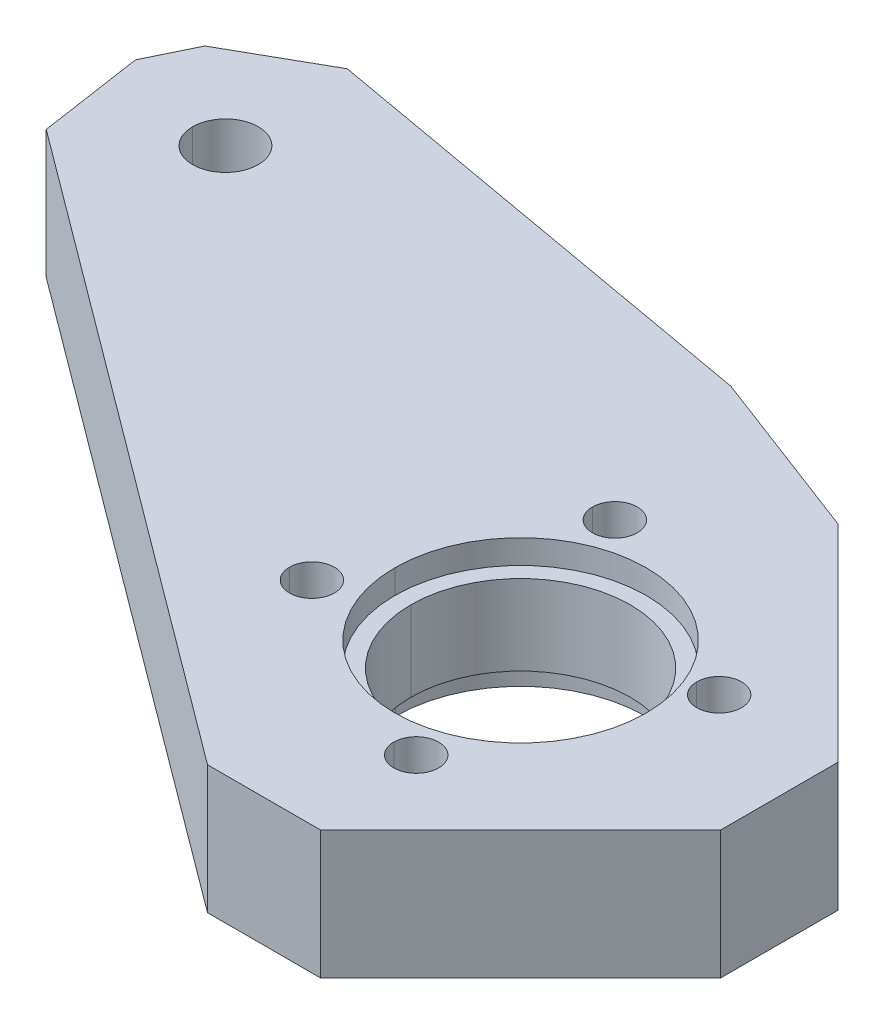
ISO-10303-21;
HEADER;
FILE_DESCRIPTION(('STEP AP214'),'2;1');
FILE_NAME('part.step','',(''),(''),'','','');
FILE_SCHEMA(('AUTOMOTIVE_DESIGN { 1 0 10303 214 1 1 1 1 }'));
ENDSEC;
DATA;
#1=APPLICATION_CONTEXT('core data for automotive mechanical design processes');
#2=APPLICATION_PROTOCOL_DEFINITION('international standard','automotive_design',2000,#1);
#3=PRODUCT_CONTEXT('',#1,'mechanical');
#4=PRODUCT('Part','Part','',(#3));
#5=PRODUCT_RELATED_PRODUCT_CATEGORY('part','',(#4));
#6=PRODUCT_DEFINITION_FORMATION('','',#4);
#7=PRODUCT_DEFINITION_CONTEXT('part definition',#1,'design');
#8=PRODUCT_DEFINITION('design','',#6,#7);
#9=PRODUCT_DEFINITION_SHAPE('','',#8);
#10=(LENGTH_UNIT() NAMED_UNIT(*) SI_UNIT(.MILLI.,.METRE.));
#11=(NAMED_UNIT(*) PLANE_ANGLE_UNIT() SI_UNIT($,.RADIAN.));
#12=(NAMED_UNIT(*) SI_UNIT($,.STERADIAN.) SOLID_ANGLE_UNIT());
#13=UNCERTAINTY_MEASURE_WITH_UNIT(LENGTH_MEASURE(1.E-05),#10,'distance_accuracy_value','');
#14=(GEOMETRIC_REPRESENTATION_CONTEXT(3) GLOBAL_UNCERTAINTY_ASSIGNED_CONTEXT((#13)) GLOBAL_UNIT_ASSIGNED_CONTEXT((#10,
#11,#12)) REPRESENTATION_CONTEXT('',''));
#15=CARTESIAN_POINT('',(0.,0.,0.));
#16=DIRECTION('',(0.,0.,1.));
#17=DIRECTION('',(1.,0.,0.));
#18=AXIS2_PLACEMENT_3D('',#15,#16,#17);
#19=CARTESIAN_POINT('',(58.0177872912911,-116.6486020619,40.2206991423906));
#20=DIRECTION('',(-0.898794046158571,0.,-0.438371147077342));
#21=DIRECTION('',(-0.438371147077342,0.,0.898794046158571));
#22=AXIS2_PLACEMENT_3D('',#19,#20,#21);
#23=PLANE('',#22);
#24=DIRECTION('',(0.,1.,0.));
#25=VECTOR('',#24,1.);
#26=CARTESIAN_POINT('',(58.0177872912911,-116.6486020619,40.2206991423906));
#27=LINE('',#26,#25);
#28=CARTESIAN_POINT('',(58.0177872912911,-43.500004703,40.2206991423906));
#29=VERTEX_POINT('',#28);
#30=CARTESIAN_POINT('',(58.0177872912911,-35.500004703,40.2206991423906));
#31=VERTEX_POINT('',#30);
#32=EDGE_CURVE('E248',#29,#31,#27,.T.);
#33=ORIENTED_EDGE('',*,*,#32,.F.);
#34=DIRECTION('',(-0.438371147077342,0.,0.898794046158571));
#35=VECTOR('',#34,1.);
#36=CARTESIAN_POINT('',(58.0177872912911,-43.500004703,40.2206991423906));
#37=LINE('',#36,#35);
#38=CARTESIAN_POINT('',(56.5968550797981,-43.500004703,43.1340419118671));
#39=VERTEX_POINT('',#38);
#40=EDGE_CURVE('E250',#29,#39,#37,.T.);
#41=ORIENTED_EDGE('',*,*,#40,.T.);
#42=DIRECTION('',(0.,1.,0.));
#43=VECTOR('',#42,1.);
#44=CARTESIAN_POINT('',(56.5968550797981,-116.6486020619,43.1340419118671));
#45=LINE('',#44,#43);
#46=CARTESIAN_POINT('',(56.5968550797981,-35.500004703,43.1340419118671));
#47=VERTEX_POINT('',#46);
#48=EDGE_CURVE('E11',#39,#47,#45,.T.);
#49=ORIENTED_EDGE('',*,*,#48,.T.);
#50=DIRECTION('',(-0.438371147077342,0.,0.898794046158571));
#51=VECTOR('',#50,1.);
#52=CARTESIAN_POINT('',(58.0177872912911,-35.500004703,40.2206991423906));
#53=LINE('',#52,#51);
#54=EDGE_CURVE('E253',#31,#47,#53,.T.);
#55=ORIENTED_EDGE('',*,*,#54,.F.);
#56=EDGE_LOOP('',(#33,#41,#49,#55));
#57=FACE_BOUND('',#56,.T.);
#58=ADVANCED_FACE('F16',(#57),#23,.T.);
#59=CARTESIAN_POINT('',(56.5968550797981,-116.6486020619,43.1340419118671));
#60=DIRECTION('',(-0.989059110515778,0.,0.147519747511098));
#61=DIRECTION('',(0.,1.,0.));
#62=AXIS2_PLACEMENT_3D('',#59,#60,#61);
#63=PLANE('',#62);
#64=ORIENTED_EDGE('',*,*,#48,.F.);
#65=DIRECTION('',(0.147519747511098,0.,0.989059110515778));
#66=VECTOR('',#65,1.);
#67=CARTESIAN_POINT('',(56.5968550797981,-43.500004703,43.1340419118671));
#68=LINE('',#67,#66);
#69=CARTESIAN_POINT('',(57.5738866518634,-43.500004703,49.6846359436255));
#70=VERTEX_POINT('',#69);
#71=EDGE_CURVE('E268',#39,#70,#68,.T.);
#72=ORIENTED_EDGE('',*,*,#71,.T.);
#73=DIRECTION('',(0.,1.,0.));
#74=VECTOR('',#73,1.);
#75=CARTESIAN_POINT('',(57.5738866518634,-116.6486020619,49.6846359436255));
#76=LINE('',#75,#74);
#77=CARTESIAN_POINT('',(57.5738866518634,-35.500004703,49.6846359436255));
#78=VERTEX_POINT('',#77);
#79=EDGE_CURVE('E19',#70,#78,#76,.T.);
#80=ORIENTED_EDGE('',*,*,#79,.T.);
#81=DIRECTION('',(0.147519747511098,0.,0.989059110515778));
#82=VECTOR('',#81,1.);
#83=CARTESIAN_POINT('',(56.5968550797981,-35.500004703,43.1340419118671));
#84=LINE('',#83,#82);
#85=EDGE_CURVE('E453',#47,#78,#84,.T.);
#86=ORIENTED_EDGE('',*,*,#85,.F.);
#87=EDGE_LOOP('',(#64,#72,#80,#86));
#88=FACE_BOUND('',#87,.T.);
#89=ADVANCED_FACE('F554',(#88),#63,.T.);
#90=CARTESIAN_POINT('',(57.5738866518634,-116.6486020619,49.6846359436255));
#91=DIRECTION('',(-0.597091059082043,0.,0.802173464510192));
#92=DIRECTION('',(0.,1.,0.));
#93=AXIS2_PLACEMENT_3D('',#90,#91,#92);
#94=PLANE('',#93);
#95=ORIENTED_EDGE('',*,*,#79,.F.);
#96=DIRECTION('',(0.802173464510192,0.,0.597091059082043));
#97=VECTOR('',#96,1.);
#98=CARTESIAN_POINT('',(57.5738866518634,-43.500004703,49.6846359436255));
#99=LINE('',#98,#97);
#100=CARTESIAN_POINT('',(96.9523845078725,-43.500004703,78.995689014));
#101=VERTEX_POINT('',#100);
#102=EDGE_CURVE('E303',#70,#101,#99,.T.);
#103=ORIENTED_EDGE('',*,*,#102,.T.);
#104=DIRECTION('',(0.,1.,0.));
#105=VECTOR('',#104,1.);
#106=CARTESIAN_POINT('',(96.9523845078725,-116.6486020619,78.995689014));
#107=LINE('',#106,#105);
#108=CARTESIAN_POINT('',(96.9523845078725,-35.500004703,78.995689014));
#109=VERTEX_POINT('',#108);
#110=EDGE_CURVE('E327',#101,#109,#107,.T.);
#111=ORIENTED_EDGE('',*,*,#110,.T.);
#112=DIRECTION('',(0.802173464510192,0.,0.597091059082043));
#113=VECTOR('',#112,1.);
#114=CARTESIAN_POINT('',(57.5738866518634,-35.500004703,49.6846359436255));
#115=LINE('',#114,#113);
#116=EDGE_CURVE('E457',#78,#109,#115,.T.);
#117=ORIENTED_EDGE('',*,*,#116,.F.);
#118=EDGE_LOOP('',(#95,#103,#111,#117));
#119=FACE_BOUND('',#118,.T.);
#120=ADVANCED_FACE('F559',(#119),#94,.T.);
#121=CARTESIAN_POINT('',(96.9523845078725,-116.6486020619,78.995689014));
#122=DIRECTION('',(0.,0.,1.));
#123=DIRECTION('',(1.,0.,0.));
#124=AXIS2_PLACEMENT_3D('',#121,#122,#123);
#125=PLANE('',#124);
#126=ORIENTED_EDGE('',*,*,#110,.F.);
#127=DIRECTION('',(1.,0.,0.));
#128=VECTOR('',#127,1.);
#129=CARTESIAN_POINT('',(96.9523845078725,-43.500004703,78.995689014));
#130=LINE('',#129,#128);
#131=CARTESIAN_POINT('',(104.010446024746,-43.500004703,78.995689014));
#132=VERTEX_POINT('',#131);
#133=EDGE_CURVE('E298',#101,#132,#130,.T.);
#134=ORIENTED_EDGE('',*,*,#133,.T.);
#135=DIRECTION('',(0.,1.,0.));
#136=VECTOR('',#135,1.);
#137=CARTESIAN_POINT('',(104.010446024746,-116.6486020619,78.995689014));
#138=LINE('',#137,#136);
#139=CARTESIAN_POINT('',(104.010446024746,-35.500004703,78.995689014));
#140=VERTEX_POINT('',#139);
#141=EDGE_CURVE('E326',#132,#140,#138,.T.);
#142=ORIENTED_EDGE('',*,*,#141,.T.);
#143=DIRECTION('',(1.,0.,0.));
#144=VECTOR('',#143,1.);
#145=CARTESIAN_POINT('',(96.9523845078725,-35.500004703,78.995689014));
#146=LINE('',#145,#144);
#147=EDGE_CURVE('E461',#109,#140,#146,.T.);
#148=ORIENTED_EDGE('',*,*,#147,.F.);
#149=EDGE_LOOP('',(#126,#134,#142,#148));
#150=FACE_BOUND('',#149,.T.);
#151=ADVANCED_FACE('F564',(#150),#125,.T.);
#152=CARTESIAN_POINT('',(104.010446024746,-116.6486020619,78.995689014));
#153=DIRECTION('',(0.707106781186548,0.,0.707106781186548));
#154=DIRECTION('',(0.,-1.,0.));
#155=AXIS2_PLACEMENT_3D('',#152,#153,#154);
#156=PLANE('',#155);
#157=ORIENTED_EDGE('',*,*,#141,.F.);
#158=DIRECTION('',(0.707106781186548,0.,-0.707106781186548));
#159=VECTOR('',#158,1.);
#160=CARTESIAN_POINT('',(104.010446024746,-43.500004703,78.995689014));
#161=LINE('',#160,#159);
#162=CARTESIAN_POINT('',(116.495727399,-43.500004703,66.5104076397462));
#163=VERTEX_POINT('',#162);
#164=EDGE_CURVE('E294',#132,#163,#161,.T.);
#165=ORIENTED_EDGE('',*,*,#164,.T.);
#166=DIRECTION('',(0.,1.,0.));
#167=VECTOR('',#166,1.);
#168=CARTESIAN_POINT('',(116.495727399,-116.6486020619,66.5104076397462));
#169=LINE('',#168,#167);
#170=CARTESIAN_POINT('',(116.495727399,-35.500004703,66.5104076397462));
#171=VERTEX_POINT('',#170);
#172=EDGE_CURVE('E323',#163,#171,#169,.T.);
#173=ORIENTED_EDGE('',*,*,#172,.T.);
#174=DIRECTION('',(0.707106781186548,0.,-0.707106781186548));
#175=VECTOR('',#174,1.);
#176=CARTESIAN_POINT('',(104.010446024746,-35.500004703,78.995689014));
#177=LINE('',#176,#175);
#178=EDGE_CURVE('E464',#140,#171,#177,.T.);
#179=ORIENTED_EDGE('',*,*,#178,.F.);
#180=EDGE_LOOP('',(#157,#165,#173,#179));
#181=FACE_BOUND('',#180,.T.);
#182=ADVANCED_FACE('F569',(#181),#156,.T.);
#183=CARTESIAN_POINT('',(116.495727399,-116.6486020619,66.5104076397462));
#184=DIRECTION('',(1.,0.,0.));
#185=DIRECTION('',(0.,1.,0.));
#186=AXIS2_PLACEMENT_3D('',#183,#184,#185);
#187=PLANE('',#186);
#188=ORIENTED_EDGE('',*,*,#172,.F.);
#189=DIRECTION('',(0.,0.,-1.));
#190=VECTOR('',#189,1.);
#191=CARTESIAN_POINT('',(116.495727399,-43.500004703,66.5104076397462));
#192=LINE('',#191,#190);
#193=CARTESIAN_POINT('',(116.495727399,-43.500004703,59.1966991412538));
#194=VERTEX_POINT('',#193);
#195=EDGE_CURVE('E299',#163,#194,#192,.T.);
#196=ORIENTED_EDGE('',*,*,#195,.T.);
#197=DIRECTION('',(0.,1.,0.));
#198=VECTOR('',#197,1.);
#199=CARTESIAN_POINT('',(116.495727399,-116.6486020619,59.1966991412538));
#200=LINE('',#199,#198);
#201=CARTESIAN_POINT('',(116.495727399,-35.500004703,59.1966991412538));
#202=VERTEX_POINT('',#201);
#203=EDGE_CURVE('E320',#194,#202,#200,.T.);
#204=ORIENTED_EDGE('',*,*,#203,.T.);
#205=DIRECTION('',(0.,0.,-1.));
#206=VECTOR('',#205,1.);
#207=CARTESIAN_POINT('',(116.495727399,-35.500004703,66.5104076397462));
#208=LINE('',#207,#206);
#209=EDGE_CURVE('E465',#171,#202,#208,.T.);
#210=ORIENTED_EDGE('',*,*,#209,.F.);
#211=EDGE_LOOP('',(#188,#196,#204,#210));
#212=FACE_BOUND('',#211,.T.);
#213=ADVANCED_FACE('F572',(#212),#187,.T.);
#214=CARTESIAN_POINT('',(116.495727399,-116.6486020619,59.1966991412538));
#215=DIRECTION('',(0.707106781186547,0.,-0.707106781186548));
#216=DIRECTION('',(0.,-1.,0.));
#217=AXIS2_PLACEMENT_3D('',#214,#215,#216);
#218=PLANE('',#217);
#219=ORIENTED_EDGE('',*,*,#203,.F.);
#220=DIRECTION('',(-0.707106781186548,0.,-0.707106781186547));
#221=VECTOR('',#220,1.);
#222=CARTESIAN_POINT('',(116.495727399,-43.500004703,59.1966991412538));
#223=LINE('',#222,#221);
#224=CARTESIAN_POINT('',(103.586027530498,-43.500004703,46.2869992727514));
#225=VERTEX_POINT('',#224);
#226=EDGE_CURVE('E293',#194,#225,#223,.T.);
#227=ORIENTED_EDGE('',*,*,#226,.T.);
#228=DIRECTION('',(0.,1.,0.));
#229=VECTOR('',#228,1.);
#230=CARTESIAN_POINT('',(103.586027530498,-116.6486020619,46.2869992727514));
#231=LINE('',#230,#229);
#232=CARTESIAN_POINT('',(103.586027530498,-35.500004703,46.2869992727514));
#233=VERTEX_POINT('',#232);
#234=EDGE_CURVE('E324',#225,#233,#231,.T.);
#235=ORIENTED_EDGE('',*,*,#234,.T.);
#236=DIRECTION('',(-0.707106781186548,0.,-0.707106781186547));
#237=VECTOR('',#236,1.);
#238=CARTESIAN_POINT('',(116.495727399,-35.500004703,59.1966991412538));
#239=LINE('',#238,#237);
#240=EDGE_CURVE('E341',#202,#233,#239,.T.);
#241=ORIENTED_EDGE('',*,*,#240,.F.);
#242=EDGE_LOOP('',(#219,#227,#235,#241));
#243=FACE_BOUND('',#242,.T.);
#244=ADVANCED_FACE('F576',(#243),#218,.T.);
#245=CARTESIAN_POINT('',(103.586027530498,-116.6486020619,46.2869992727514));
#246=DIRECTION('',(0.35521182756565,0.,-0.934785835128812));
#247=DIRECTION('',(0.,-1.,0.));
#248=AXIS2_PLACEMENT_3D('',#245,#246,#247);
#249=PLANE('',#248);
#250=ORIENTED_EDGE('',*,*,#234,.F.);
#251=DIRECTION('',(-0.934785835128812,0.,-0.35521182756565));
#252=VECTOR('',#251,1.);
#253=CARTESIAN_POINT('',(103.586027530498,-43.500004703,46.2869992727514));
#254=LINE('',#253,#252);
#255=CARTESIAN_POINT('',(92.822153420475,-43.500004703,42.1968052939554));
#256=VERTEX_POINT('',#255);
#257=EDGE_CURVE('E283',#225,#256,#254,.T.);
#258=ORIENTED_EDGE('',*,*,#257,.T.);
#259=DIRECTION('',(0.,1.,0.));
#260=VECTOR('',#259,1.);
#261=CARTESIAN_POINT('',(92.822153420475,-116.6486020619,42.1968052939554));
#262=LINE('',#261,#260);
#263=CARTESIAN_POINT('',(92.822153420475,-35.500004703,42.1968052939554));
#264=VERTEX_POINT('',#263);
#265=EDGE_CURVE('E259',#256,#264,#262,.T.);
#266=ORIENTED_EDGE('',*,*,#265,.T.);
#267=DIRECTION('',(-0.934785835128812,0.,-0.35521182756565));
#268=VECTOR('',#267,1.);
#269=CARTESIAN_POINT('',(103.586027530498,-35.500004703,46.2869992727514));
#270=LINE('',#269,#268);
#271=EDGE_CURVE('E348',#233,#264,#270,.T.);
#272=ORIENTED_EDGE('',*,*,#271,.F.);
#273=EDGE_LOOP('',(#250,#258,#266,#272));
#274=FACE_BOUND('',#273,.T.);
#275=ADVANCED_FACE('F580',(#274),#249,.T.);
#276=CARTESIAN_POINT('',(92.822153420475,-116.6486020619,42.1968052939554));
#277=DIRECTION('',(0.17530314267094,0.,-0.984514503788386));
#278=DIRECTION('',(0.,-1.,0.));
#279=AXIS2_PLACEMENT_3D('',#276,#277,#278);
#280=PLANE('',#279);
#281=ORIENTED_EDGE('',*,*,#265,.F.);
#282=DIRECTION('',(-0.984514503788386,0.,-0.17530314267094));
#283=VECTOR('',#282,1.);
#284=CARTESIAN_POINT('',(92.822153420475,-43.500004703,42.1968052939554));
#285=LINE('',#284,#283);
#286=CARTESIAN_POINT('',(63.6897348581458,-43.500004703,37.0094723415916));
#287=VERTEX_POINT('',#286);
#288=EDGE_CURVE('E275',#256,#287,#285,.T.);
#289=ORIENTED_EDGE('',*,*,#288,.T.);
#290=DIRECTION('',(0.,1.,0.));
#291=VECTOR('',#290,1.);
#292=CARTESIAN_POINT('',(63.6897348581458,-116.6486020619,37.0094723415916));
#293=LINE('',#292,#291);
#294=CARTESIAN_POINT('',(63.6897348581458,-35.500004703,37.0094723415916));
#295=VERTEX_POINT('',#294);
#296=EDGE_CURVE('E260',#287,#295,#293,.T.);
#297=ORIENTED_EDGE('',*,*,#296,.T.);
#298=DIRECTION('',(-0.984514503788386,0.,-0.17530314267094));
#299=VECTOR('',#298,1.);
#300=CARTESIAN_POINT('',(92.822153420475,-35.500004703,42.1968052939554));
#301=LINE('',#300,#299);
#302=EDGE_CURVE('E343',#264,#295,#301,.T.);
#303=ORIENTED_EDGE('',*,*,#302,.F.);
#304=EDGE_LOOP('',(#281,#289,#297,#303));
#305=FACE_BOUND('',#304,.T.);
#306=ADVANCED_FACE('F583',(#305),#280,.T.);
#307=CARTESIAN_POINT('',(63.6897348581458,-116.6486020619,37.0094723415916));
#308=DIRECTION('',(-0.492678443698932,0.,-0.870211440463982));
#309=DIRECTION('',(-0.870211440463982,0.,0.492678443698932));
#310=AXIS2_PLACEMENT_3D('',#307,#308,#309);
#311=PLANE('',#310);
#312=ORIENTED_EDGE('',*,*,#296,.F.);
#313=DIRECTION('',(-0.870211440463982,0.,0.492678443698932));
#314=VECTOR('',#313,1.);
#315=CARTESIAN_POINT('',(63.6897348581458,-43.500004703,37.0094723415916));
#316=LINE('',#315,#314);
#317=EDGE_CURVE('E266',#287,#29,#316,.T.);
#318=ORIENTED_EDGE('',*,*,#317,.T.);
#319=ORIENTED_EDGE('',*,*,#32,.T.);
#320=DIRECTION('',(-0.870211440463982,0.,0.492678443698932));
#321=VECTOR('',#320,1.);
#322=CARTESIAN_POINT('',(63.6897348581458,-35.500004703,37.0094723415916));
#323=LINE('',#322,#321);
#324=EDGE_CURVE('E448',#295,#31,#323,.T.);
#325=ORIENTED_EDGE('',*,*,#324,.F.);
#326=EDGE_LOOP('',(#312,#318,#319,#325));
#327=FACE_BOUND('',#326,.T.);
#328=ADVANCED_FACE('F272',(#327),#311,.T.);
#329=CARTESIAN_POINT('',(100.000038384,-41.500004703,62.5));
#330=DIRECTION('',(0.,1.,0.));
#331=DIRECTION('',(-1.,0.,0.));
#332=AXIS2_PLACEMENT_3D('',#329,#330,#331);
#333=CYLINDRICAL_SURFACE('',#332,7.85);
#334=DIRECTION('',(0.,1.,0.));
#335=VECTOR('',#334,1.);
#336=CARTESIAN_POINT('',(107.850038384,-41.500004703,62.5));
#337=LINE('',#336,#335);
#338=CARTESIAN_POINT('',(107.850038384,-37.000004703,62.5));
#339=VERTEX_POINT('',#338);
#340=CARTESIAN_POINT('',(107.850038384,-35.500004703,62.5));
#341=VERTEX_POINT('',#340);
#342=EDGE_CURVE('E687',#339,#341,#337,.T.);
#343=ORIENTED_EDGE('',*,*,#342,.F.);
#344=CARTESIAN_POINT('',(100.000038384,-37.000004703,62.5));
#345=DIRECTION('',(0.,-1.,0.));
#346=DIRECTION('',(0.,0.,-1.));
#347=AXIS2_PLACEMENT_3D('',#344,#345,#346);
#348=CIRCLE('',#347,7.85);
#349=CARTESIAN_POINT('',(92.150038384,-37.000004703,62.5));
#350=VERTEX_POINT('',#349);
#351=EDGE_CURVE('E436',#339,#350,#348,.T.);
#352=ORIENTED_EDGE('',*,*,#351,.T.);
#353=DIRECTION('',(0.,1.,0.));
#354=VECTOR('',#353,1.);
#355=CARTESIAN_POINT('',(92.150038384,-41.500004703,62.5));
#356=LINE('',#355,#354);
#357=CARTESIAN_POINT('',(92.150038384,-35.500004703,62.5));
#358=VERTEX_POINT('',#357);
#359=EDGE_CURVE('E481',#350,#358,#356,.T.);
#360=ORIENTED_EDGE('',*,*,#359,.T.);
#361=CARTESIAN_POINT('',(100.000038384,-35.500004703,62.5));
#362=DIRECTION('',(0.,-1.,0.));
#363=DIRECTION('',(0.,0.,-1.));
#364=AXIS2_PLACEMENT_3D('',#361,#362,#363);
#365=CIRCLE('',#364,7.85);
#366=EDGE_CURVE('E276',#341,#358,#365,.T.);
#367=ORIENTED_EDGE('',*,*,#366,.F.);
#368=EDGE_LOOP('',(#343,#352,#360,#367));
#369=FACE_BOUND('',#368,.T.);
#370=ADVANCED_FACE('F589',(#369),#333,.F.);
#371=CARTESIAN_POINT('',(102.940745878,-41.500004703,71.955185756));
#372=DIRECTION('',(0.,1.,0.));
#373=DIRECTION('',(-1.,0.,0.));
#374=AXIS2_PLACEMENT_3D('',#371,#372,#373);
#375=CYLINDRICAL_SURFACE('',#374,1.4);
#376=DIRECTION('',(0.,1.,0.));
#377=VECTOR('',#376,1.);
#378=CARTESIAN_POINT('',(104.340745878,-41.500004703,71.955185756));
#379=LINE('',#378,#377);
#380=CARTESIAN_POINT('',(104.340745878,-43.500004703,71.955185756));
#381=VERTEX_POINT('',#380);
#382=CARTESIAN_POINT('',(104.340745878,-35.500004703,71.955185756));
#383=VERTEX_POINT('',#382);
#384=EDGE_CURVE('E487',#381,#383,#379,.T.);
#385=ORIENTED_EDGE('',*,*,#384,.F.);
#386=CARTESIAN_POINT('',(102.940745878,-43.500004703,71.955185756));
#387=DIRECTION('',(0.,-1.,0.));
#388=DIRECTION('',(0.,0.,-1.));
#389=AXIS2_PLACEMENT_3D('',#386,#387,#388);
#390=CIRCLE('',#389,1.4);
#391=CARTESIAN_POINT('',(101.540745878,-43.500004703,71.955185756));
#392=VERTEX_POINT('',#391);
#393=EDGE_CURVE('E308',#381,#392,#390,.T.);
#394=ORIENTED_EDGE('',*,*,#393,.T.);
#395=DIRECTION('',(0.,1.,0.));
#396=VECTOR('',#395,1.);
#397=CARTESIAN_POINT('',(101.540745878,-41.500004703,71.955185756));
#398=LINE('',#397,#396);
#399=CARTESIAN_POINT('',(101.540745878,-35.500004703,71.955185756));
#400=VERTEX_POINT('',#399);
#401=EDGE_CURVE('E495',#392,#400,#398,.T.);
#402=ORIENTED_EDGE('',*,*,#401,.T.);
#403=CARTESIAN_POINT('',(102.940745878,-35.500004703,71.955185756));
#404=DIRECTION('',(0.,-1.,0.));
#405=DIRECTION('',(1.,0.,0.));
#406=AXIS2_PLACEMENT_3D('',#403,#404,#405);
#407=CIRCLE('',#406,1.4);
#408=EDGE_CURVE('E351',#383,#400,#407,.T.);
#409=ORIENTED_EDGE('',*,*,#408,.F.);
#410=EDGE_LOOP('',(#385,#394,#402,#409));
#411=FACE_BOUND('',#410,.T.);
#412=ADVANCED_FACE('F592',(#411),#375,.F.);
#413=CARTESIAN_POINT('',(90.229878577,-41.500004703,65.755681545));
#414=DIRECTION('',(0.,1.,0.));
#415=DIRECTION('',(-1.,0.,0.));
#416=AXIS2_PLACEMENT_3D('',#413,#414,#415);
#417=CYLINDRICAL_SURFACE('',#416,1.4);
#418=DIRECTION('',(0.,1.,0.));
#419=VECTOR('',#418,1.);
#420=CARTESIAN_POINT('',(91.629878577,-41.500004703,65.755681545));
#421=LINE('',#420,#419);
#422=CARTESIAN_POINT('',(91.629878577,-43.500004703,65.755681545));
#423=VERTEX_POINT('',#422);
#424=CARTESIAN_POINT('',(91.629878577,-35.500004703,65.755681545));
#425=VERTEX_POINT('',#424);
#426=EDGE_CURVE('E496',#423,#425,#421,.T.);
#427=ORIENTED_EDGE('',*,*,#426,.F.);
#428=CARTESIAN_POINT('',(90.229878577,-43.500004703,65.755681545));
#429=DIRECTION('',(0.,-1.,0.));
#430=DIRECTION('',(0.,0.,-1.));
#431=AXIS2_PLACEMENT_3D('',#428,#429,#430);
#432=CIRCLE('',#431,1.4);
#433=CARTESIAN_POINT('',(88.829878577,-43.500004703,65.755681545));
#434=VERTEX_POINT('',#433);
#435=EDGE_CURVE('E311',#423,#434,#432,.T.);
#436=ORIENTED_EDGE('',*,*,#435,.T.);
#437=DIRECTION('',(0.,1.,0.));
#438=VECTOR('',#437,1.);
#439=CARTESIAN_POINT('',(88.829878577,-41.500004703,65.755681545));
#440=LINE('',#439,#438);
#441=CARTESIAN_POINT('',(88.829878577,-35.500004703,65.755681545));
#442=VERTEX_POINT('',#441);
#443=EDGE_CURVE('E507',#434,#442,#440,.T.);
#444=ORIENTED_EDGE('',*,*,#443,.T.);
#445=CARTESIAN_POINT('',(90.229878577,-35.500004703,65.755681545));
#446=DIRECTION('',(0.,-1.,0.));
#447=DIRECTION('',(1.,0.,0.));
#448=AXIS2_PLACEMENT_3D('',#445,#446,#447);
#449=CIRCLE('',#448,1.4);
#450=EDGE_CURVE('E357',#425,#442,#449,.T.);
#451=ORIENTED_EDGE('',*,*,#450,.F.);
#452=EDGE_LOOP('',(#427,#436,#444,#451));
#453=FACE_BOUND('',#452,.T.);
#454=ADVANCED_FACE('F596',(#453),#417,.F.);
#455=CARTESIAN_POINT('',(64.046053168,-41.500004703,44.969712702));
#456=DIRECTION('',(0.,1.,0.));
#457=DIRECTION('',(-1.,0.,0.));
#458=AXIS2_PLACEMENT_3D('',#455,#456,#457);
#459=CYLINDRICAL_SURFACE('',#458,2.05);
#460=DIRECTION('',(0.,1.,0.));
#461=VECTOR('',#460,1.);
#462=CARTESIAN_POINT('',(66.096053168,-41.500004703,44.969712702));
#463=LINE('',#462,#461);
#464=CARTESIAN_POINT('',(66.096053168,-43.500004703,44.969712702));
#465=VERTEX_POINT('',#464);
#466=CARTESIAN_POINT('',(66.096053168,-35.500004703,44.969712702));
#467=VERTEX_POINT('',#466);
#468=EDGE_CURVE('E506',#465,#467,#463,.T.);
#469=ORIENTED_EDGE('',*,*,#468,.F.);
#470=CARTESIAN_POINT('',(64.046053168,-43.500004703,44.969712702));
#471=DIRECTION('',(0.,-1.,0.));
#472=DIRECTION('',(0.,0.,-1.));
#473=AXIS2_PLACEMENT_3D('',#470,#471,#472);
#474=CIRCLE('',#473,2.05);
#475=CARTESIAN_POINT('',(61.996053168,-43.500004703,44.969712702));
#476=VERTEX_POINT('',#475);
#477=EDGE_CURVE('E288',#465,#476,#474,.T.);
#478=ORIENTED_EDGE('',*,*,#477,.T.);
#479=DIRECTION('',(0.,1.,0.));
#480=VECTOR('',#479,1.);
#481=CARTESIAN_POINT('',(61.996053168,-41.500004703,44.969712702));
#482=LINE('',#481,#480);
#483=CARTESIAN_POINT('',(61.996053168,-35.500004703,44.969712702));
#484=VERTEX_POINT('',#483);
#485=EDGE_CURVE('E515',#476,#484,#482,.T.);
#486=ORIENTED_EDGE('',*,*,#485,.T.);
#487=CARTESIAN_POINT('',(64.046053168,-35.500004703,44.969712702));
#488=DIRECTION('',(0.,-1.,0.));
#489=DIRECTION('',(0.,0.,-1.));
#490=AXIS2_PLACEMENT_3D('',#487,#488,#489);
#491=CIRCLE('',#490,2.05);
#492=EDGE_CURVE('E360',#467,#484,#491,.T.);
#493=ORIENTED_EDGE('',*,*,#492,.F.);
#494=EDGE_LOOP('',(#469,#478,#486,#493));
#495=FACE_BOUND('',#494,.T.);
#496=ADVANCED_FACE('F598',(#495),#459,.F.);
#497=CARTESIAN_POINT('',(109.140250089,-41.500004703,59.244318455));
#498=DIRECTION('',(0.,1.,0.));
#499=DIRECTION('',(-1.,0.,0.));
#500=AXIS2_PLACEMENT_3D('',#497,#498,#499);
#501=CYLINDRICAL_SURFACE('',#500,1.4);
#502=DIRECTION('',(0.,1.,0.));
#503=VECTOR('',#502,1.);
#504=CARTESIAN_POINT('',(110.540250089,-41.500004703,59.244318455));
#505=LINE('',#504,#503);
#506=CARTESIAN_POINT('',(110.540250089,-43.500004703,59.244318455));
#507=VERTEX_POINT('',#506);
#508=CARTESIAN_POINT('',(110.540250089,-35.500004703,59.244318455));
#509=VERTEX_POINT('',#508);
#510=EDGE_CURVE('E379',#507,#509,#505,.T.);
#511=ORIENTED_EDGE('',*,*,#510,.F.);
#512=CARTESIAN_POINT('',(109.140250089,-43.500004703,59.244318455));
#513=DIRECTION('',(0.,-1.,0.));
#514=DIRECTION('',(0.,0.,-1.));
#515=AXIS2_PLACEMENT_3D('',#512,#513,#514);
#516=CIRCLE('',#515,1.4);
#517=CARTESIAN_POINT('',(107.740250089,-43.500004703,59.244318455));
#518=VERTEX_POINT('',#517);
#519=EDGE_CURVE('E314',#507,#518,#516,.T.);
#520=ORIENTED_EDGE('',*,*,#519,.T.);
#521=DIRECTION('',(0.,1.,0.));
#522=VECTOR('',#521,1.);
#523=CARTESIAN_POINT('',(107.740250089,-41.500004703,59.244318455));
#524=LINE('',#523,#522);
#525=CARTESIAN_POINT('',(107.740250089,-35.500004703,59.244318455));
#526=VERTEX_POINT('',#525);
#527=EDGE_CURVE('E388',#518,#526,#524,.T.);
#528=ORIENTED_EDGE('',*,*,#527,.T.);
#529=CARTESIAN_POINT('',(109.140250089,-35.500004703,59.244318455));
#530=DIRECTION('',(0.,-1.,0.));
#531=DIRECTION('',(1.,0.,0.));
#532=AXIS2_PLACEMENT_3D('',#529,#530,#531);
#533=CIRCLE('',#532,1.4);
#534=EDGE_CURVE('E285',#509,#526,#533,.T.);
#535=ORIENTED_EDGE('',*,*,#534,.F.);
#536=EDGE_LOOP('',(#511,#520,#528,#535));
#537=FACE_BOUND('',#536,.T.);
#538=ADVANCED_FACE('F600',(#537),#501,.F.);
#539=CARTESIAN_POINT('',(100.000038384,-41.500004703,62.5));
#540=DIRECTION('',(0.,1.,0.));
#541=DIRECTION('',(-1.,0.,0.));
#542=AXIS2_PLACEMENT_3D('',#539,#540,#541);
#543=CYLINDRICAL_SURFACE('',#542,7.8);
#544=DIRECTION('',(0.,1.,0.));
#545=VECTOR('',#544,1.);
#546=CARTESIAN_POINT('',(107.800038384,-41.500004703,62.5));
#547=LINE('',#546,#545);
#548=CARTESIAN_POINT('',(107.800038384,-43.500004703,62.5));
#549=VERTEX_POINT('',#548);
#550=CARTESIAN_POINT('',(107.800038384,-42.000004703,62.5));
#551=VERTEX_POINT('',#550);
#552=EDGE_CURVE('E396',#549,#551,#547,.T.);
#553=ORIENTED_EDGE('',*,*,#552,.F.);
#554=CARTESIAN_POINT('',(100.000038384,-43.500004703,62.5));
#555=DIRECTION('',(0.,-1.,0.));
#556=DIRECTION('',(0.,0.,-1.));
#557=AXIS2_PLACEMENT_3D('',#554,#555,#556);
#558=CIRCLE('',#557,7.8);
#559=CARTESIAN_POINT('',(92.200038384,-43.500004703,62.5));
#560=VERTEX_POINT('',#559);
#561=EDGE_CURVE('E317',#549,#560,#558,.T.);
#562=ORIENTED_EDGE('',*,*,#561,.T.);
#563=DIRECTION('',(0.,1.,0.));
#564=VECTOR('',#563,1.);
#565=CARTESIAN_POINT('',(92.200038384,-41.500004703,62.5));
#566=LINE('',#565,#564);
#567=CARTESIAN_POINT('',(92.200038384,-42.000004703,62.5));
#568=VERTEX_POINT('',#567);
#569=EDGE_CURVE('E404',#560,#568,#566,.T.);
#570=ORIENTED_EDGE('',*,*,#569,.T.);
#571=CARTESIAN_POINT('',(100.000038384,-42.000004703,62.5));
#572=DIRECTION('',(0.,-1.,0.));
#573=DIRECTION('',(0.,0.,-1.));
#574=AXIS2_PLACEMENT_3D('',#571,#572,#573);
#575=CIRCLE('',#574,7.8);
#576=EDGE_CURVE('E442',#551,#568,#575,.T.);
#577=ORIENTED_EDGE('',*,*,#576,.F.);
#578=EDGE_LOOP('',(#553,#562,#570,#577));
#579=FACE_BOUND('',#578,.T.);
#580=ADVANCED_FACE('F547',(#579),#543,.F.);
#581=CARTESIAN_POINT('',(96.429382788,-41.500004703,53.044814244));
#582=DIRECTION('',(0.,1.,0.));
#583=DIRECTION('',(-1.,0.,0.));
#584=AXIS2_PLACEMENT_3D('',#581,#582,#583);
#585=CYLINDRICAL_SURFACE('',#584,1.4);
#586=DIRECTION('',(0.,1.,0.));
#587=VECTOR('',#586,1.);
#588=CARTESIAN_POINT('',(97.829382788,-41.500004703,53.044814244));
#589=LINE('',#588,#587);
#590=CARTESIAN_POINT('',(97.829382788,-43.500004703,53.044814244));
#591=VERTEX_POINT('',#590);
#592=CARTESIAN_POINT('',(97.829382788,-35.500004703,53.044814244));
#593=VERTEX_POINT('',#592);
#594=EDGE_CURVE('E412',#591,#593,#589,.T.);
#595=ORIENTED_EDGE('',*,*,#594,.F.);
#596=CARTESIAN_POINT('',(96.429382788,-43.500004703,53.044814244));
#597=DIRECTION('',(0.,-1.,0.));
#598=DIRECTION('',(0.,0.,-1.));
#599=AXIS2_PLACEMENT_3D('',#596,#597,#598);
#600=CIRCLE('',#599,1.4);
#601=CARTESIAN_POINT('',(95.029382788,-43.500004703,53.044814244));
#602=VERTEX_POINT('',#601);
#603=EDGE_CURVE('E270',#591,#602,#600,.T.);
#604=ORIENTED_EDGE('',*,*,#603,.T.);
#605=DIRECTION('',(0.,1.,0.));
#606=VECTOR('',#605,1.);
#607=CARTESIAN_POINT('',(95.029382788,-41.500004703,53.044814244));
#608=LINE('',#607,#606);
#609=CARTESIAN_POINT('',(95.029382788,-35.500004703,53.044814244));
#610=VERTEX_POINT('',#609);
#611=EDGE_CURVE('E420',#602,#610,#608,.T.);
#612=ORIENTED_EDGE('',*,*,#611,.T.);
#613=CARTESIAN_POINT('',(96.429382788,-35.500004703,53.044814244));
#614=DIRECTION('',(0.,-1.,0.));
#615=DIRECTION('',(1.,0.,0.));
#616=AXIS2_PLACEMENT_3D('',#613,#614,#615);
#617=CIRCLE('',#616,1.4);
#618=EDGE_CURVE('E347',#593,#610,#617,.T.);
#619=ORIENTED_EDGE('',*,*,#618,.F.);
#620=EDGE_LOOP('',(#595,#604,#612,#619));
#621=FACE_BOUND('',#620,.T.);
#622=ADVANCED_FACE('F528',(#621),#585,.F.);
#623=CARTESIAN_POINT('',(-206.266697519,-43.500004703,299.965154128));
#624=DIRECTION('',(0.,-1.,0.));
#625=DIRECTION('',(0.,0.,-1.));
#626=AXIS2_PLACEMENT_3D('',#623,#624,#625);
#627=PLANE('',#626);
#628=CARTESIAN_POINT('',(100.000038384,-43.500004703,62.5));
#629=DIRECTION('',(0.,-1.,0.));
#630=DIRECTION('',(0.,0.,-1.));
#631=AXIS2_PLACEMENT_3D('',#628,#629,#630);
#632=CIRCLE('',#631,7.8);
#633=EDGE_CURVE('E392',#560,#549,#632,.T.);
#634=ORIENTED_EDGE('',*,*,#633,.F.);
#635=ORIENTED_EDGE('',*,*,#561,.F.);
#636=EDGE_LOOP('',(#634,#635));
#637=FACE_BOUND('',#636,.T.);
#638=CARTESIAN_POINT('',(109.140250089,-43.500004703,59.244318455));
#639=DIRECTION('',(0.,-1.,0.));
#640=DIRECTION('',(0.,0.,-1.));
#641=AXIS2_PLACEMENT_3D('',#638,#639,#640);
#642=CIRCLE('',#641,1.4);
#643=EDGE_CURVE('E519',#518,#507,#642,.T.);
#644=ORIENTED_EDGE('',*,*,#643,.F.);
#645=ORIENTED_EDGE('',*,*,#519,.F.);
#646=EDGE_LOOP('',(#644,#645));
#647=FACE_BOUND('',#646,.T.);
#648=CARTESIAN_POINT('',(64.046053168,-43.500004703,44.969712702));
#649=DIRECTION('',(0.,-1.,0.));
#650=DIRECTION('',(0.,0.,-1.));
#651=AXIS2_PLACEMENT_3D('',#648,#649,#650);
#652=CIRCLE('',#651,2.05);
#653=EDGE_CURVE('E502',#476,#465,#652,.T.);
#654=ORIENTED_EDGE('',*,*,#653,.F.);
#655=ORIENTED_EDGE('',*,*,#477,.F.);
#656=EDGE_LOOP('',(#654,#655));
#657=FACE_BOUND('',#656,.T.);
#658=CARTESIAN_POINT('',(90.229878577,-43.500004703,65.755681545));
#659=DIRECTION('',(0.,-1.,0.));
#660=DIRECTION('',(0.,0.,-1.));
#661=AXIS2_PLACEMENT_3D('',#658,#659,#660);
#662=CIRCLE('',#661,1.4);
#663=EDGE_CURVE('E501',#434,#423,#662,.T.);
#664=ORIENTED_EDGE('',*,*,#663,.F.);
#665=ORIENTED_EDGE('',*,*,#435,.F.);
#666=EDGE_LOOP('',(#664,#665));
#667=FACE_BOUND('',#666,.T.);
#668=CARTESIAN_POINT('',(102.940745878,-43.500004703,71.955185756));
#669=DIRECTION('',(0.,-1.,0.));
#670=DIRECTION('',(0.,0.,-1.));
#671=AXIS2_PLACEMENT_3D('',#668,#669,#670);
#672=CIRCLE('',#671,1.4);
#673=EDGE_CURVE('E483',#392,#381,#672,.T.);
#674=ORIENTED_EDGE('',*,*,#673,.F.);
#675=ORIENTED_EDGE('',*,*,#393,.F.);
#676=EDGE_LOOP('',(#674,#675));
#677=FACE_BOUND('',#676,.T.);
#678=CARTESIAN_POINT('',(96.429382788,-43.500004703,53.044814244));
#679=DIRECTION('',(0.,-1.,0.));
#680=DIRECTION('',(0.,0.,-1.));
#681=AXIS2_PLACEMENT_3D('',#678,#679,#680);
#682=CIRCLE('',#681,1.4);
#683=EDGE_CURVE('E408',#602,#591,#682,.T.);
#684=ORIENTED_EDGE('',*,*,#683,.F.);
#685=ORIENTED_EDGE('',*,*,#603,.F.);
#686=EDGE_LOOP('',(#684,#685));
#687=FACE_BOUND('',#686,.T.);
#688=ORIENTED_EDGE('',*,*,#317,.F.);
#689=ORIENTED_EDGE('',*,*,#288,.F.);
#690=ORIENTED_EDGE('',*,*,#257,.F.);
#691=ORIENTED_EDGE('',*,*,#226,.F.);
#692=ORIENTED_EDGE('',*,*,#195,.F.);
#693=ORIENTED_EDGE('',*,*,#164,.F.);
#694=ORIENTED_EDGE('',*,*,#133,.F.);
#695=ORIENTED_EDGE('',*,*,#102,.F.);
#696=ORIENTED_EDGE('',*,*,#71,.F.);
#697=ORIENTED_EDGE('',*,*,#40,.F.);
#698=EDGE_LOOP('',(#688,#689,#690,#691,#692,#693,#694,#695,#696,#697));
#699=FACE_BOUND('',#698,.T.);
#700=ADVANCED_FACE('F264',(#637,#647,#657,#667,#677,#687,#699),#627,.T.);
#701=CARTESIAN_POINT('',(-206.266697519,-35.500004703,299.965154128));
#702=DIRECTION('',(0.,-1.,0.));
#703=DIRECTION('',(0.,0.,-1.));
#704=AXIS2_PLACEMENT_3D('',#701,#702,#703);
#705=PLANE('',#704);
#706=CARTESIAN_POINT('',(100.000038384,-35.500004703,62.5));
#707=DIRECTION('',(0.,-1.,0.));
#708=DIRECTION('',(0.,0.,-1.));
#709=AXIS2_PLACEMENT_3D('',#706,#707,#708);
#710=CIRCLE('',#709,7.85);
#711=EDGE_CURVE('E670',#358,#341,#710,.T.);
#712=ORIENTED_EDGE('',*,*,#711,.T.);
#713=ORIENTED_EDGE('',*,*,#366,.T.);
#714=EDGE_LOOP('',(#712,#713));
#715=FACE_BOUND('',#714,.T.);
#716=CARTESIAN_POINT('',(109.140250089,-35.500004703,59.244318455));
#717=DIRECTION('',(0.,-1.,0.));
#718=DIRECTION('',(1.,0.,0.));
#719=AXIS2_PLACEMENT_3D('',#716,#717,#718);
#720=CIRCLE('',#719,1.4);
#721=EDGE_CURVE('E384',#526,#509,#720,.T.);
#722=ORIENTED_EDGE('',*,*,#721,.T.);
#723=ORIENTED_EDGE('',*,*,#534,.T.);
#724=EDGE_LOOP('',(#722,#723));
#725=FACE_BOUND('',#724,.T.);
#726=CARTESIAN_POINT('',(64.046053168,-35.500004703,44.969712702));
#727=DIRECTION('',(0.,-1.,0.));
#728=DIRECTION('',(0.,0.,-1.));
#729=AXIS2_PLACEMENT_3D('',#726,#727,#728);
#730=CIRCLE('',#729,2.05);
#731=EDGE_CURVE('E511',#484,#467,#730,.T.);
#732=ORIENTED_EDGE('',*,*,#731,.T.);
#733=ORIENTED_EDGE('',*,*,#492,.T.);
#734=EDGE_LOOP('',(#732,#733));
#735=FACE_BOUND('',#734,.T.);
#736=CARTESIAN_POINT('',(90.229878577,-35.500004703,65.755681545));
#737=DIRECTION('',(0.,-1.,0.));
#738=DIRECTION('',(1.,0.,0.));
#739=AXIS2_PLACEMENT_3D('',#736,#737,#738);
#740=CIRCLE('',#739,1.4);
#741=EDGE_CURVE('E500',#442,#425,#740,.T.);
#742=ORIENTED_EDGE('',*,*,#741,.T.);
#743=ORIENTED_EDGE('',*,*,#450,.T.);
#744=EDGE_LOOP('',(#742,#743));
#745=FACE_BOUND('',#744,.T.);
#746=CARTESIAN_POINT('',(102.940745878,-35.500004703,71.955185756));
#747=DIRECTION('',(0.,-1.,0.));
#748=DIRECTION('',(1.,0.,0.));
#749=AXIS2_PLACEMENT_3D('',#746,#747,#748);
#750=CIRCLE('',#749,1.4);
#751=EDGE_CURVE('E491',#400,#383,#750,.T.);
#752=ORIENTED_EDGE('',*,*,#751,.T.);
#753=ORIENTED_EDGE('',*,*,#408,.T.);
#754=EDGE_LOOP('',(#752,#753));
#755=FACE_BOUND('',#754,.T.);
#756=CARTESIAN_POINT('',(96.429382788,-35.500004703,53.044814244));
#757=DIRECTION('',(0.,-1.,0.));
#758=DIRECTION('',(1.,0.,0.));
#759=AXIS2_PLACEMENT_3D('',#756,#757,#758);
#760=CIRCLE('',#759,1.4);
#761=EDGE_CURVE('E416',#610,#593,#760,.T.);
#762=ORIENTED_EDGE('',*,*,#761,.T.);
#763=ORIENTED_EDGE('',*,*,#618,.T.);
#764=EDGE_LOOP('',(#762,#763));
#765=FACE_BOUND('',#764,.T.);
#766=ORIENTED_EDGE('',*,*,#324,.T.);
#767=ORIENTED_EDGE('',*,*,#54,.T.);
#768=ORIENTED_EDGE('',*,*,#85,.T.);
#769=ORIENTED_EDGE('',*,*,#116,.T.);
#770=ORIENTED_EDGE('',*,*,#147,.T.);
#771=ORIENTED_EDGE('',*,*,#178,.T.);
#772=ORIENTED_EDGE('',*,*,#209,.T.);
#773=ORIENTED_EDGE('',*,*,#240,.T.);
#774=ORIENTED_EDGE('',*,*,#271,.T.);
#775=ORIENTED_EDGE('',*,*,#302,.T.);
#776=EDGE_LOOP('',(#766,#767,#768,#769,#770,#771,#772,#773,#774,#775));
#777=FACE_BOUND('',#776,.T.);
#778=ADVANCED_FACE('F535',(#715,#725,#735,#745,#755,#765,#777),#705,.F.);
#779=CARTESIAN_POINT('',(100.000038384,-40.500004703,62.5));
#780=DIRECTION('',(0.,1.,0.));
#781=DIRECTION('',(-1.,0.,0.));
#782=AXIS2_PLACEMENT_3D('',#779,#780,#781);
#783=CYLINDRICAL_SURFACE('',#782,6.85);
#784=DIRECTION('',(0.,1.,0.));
#785=VECTOR('',#784,1.);
#786=CARTESIAN_POINT('',(106.850038384,-40.500004703,62.5));
#787=LINE('',#786,#785);
#788=CARTESIAN_POINT('',(106.850038384,-42.000004703,62.5));
#789=VERTEX_POINT('',#788);
#790=CARTESIAN_POINT('',(106.850038384,-37.000004703,62.5));
#791=VERTEX_POINT('',#790);
#792=EDGE_CURVE('E426',#789,#791,#787,.T.);
#793=ORIENTED_EDGE('',*,*,#792,.F.);
#794=CARTESIAN_POINT('',(100.000038384,-42.000004703,62.5));
#795=DIRECTION('',(0.,-1.,0.));
#796=DIRECTION('',(0.,0.,-1.));
#797=AXIS2_PLACEMENT_3D('',#794,#795,#796);
#798=CIRCLE('',#797,6.85);
#799=CARTESIAN_POINT('',(93.150038384,-42.000004703,62.5));
#800=VERTEX_POINT('',#799);
#801=EDGE_CURVE('E445',#789,#800,#798,.T.);
#802=ORIENTED_EDGE('',*,*,#801,.T.);
#803=DIRECTION('',(0.,1.,0.));
#804=VECTOR('',#803,1.);
#805=CARTESIAN_POINT('',(93.150038384,-40.500004703,62.5));
#806=LINE('',#805,#804);
#807=CARTESIAN_POINT('',(93.150038384,-37.000004703,62.5));
#808=VERTEX_POINT('',#807);
#809=EDGE_CURVE('E425',#800,#808,#806,.T.);
#810=ORIENTED_EDGE('',*,*,#809,.T.);
#811=CARTESIAN_POINT('',(100.000038384,-37.000004703,62.5));
#812=DIRECTION('',(0.,-1.,0.));
#813=DIRECTION('',(0.,0.,-1.));
#814=AXIS2_PLACEMENT_3D('',#811,#812,#813);
#815=CIRCLE('',#814,6.85);
#816=EDGE_CURVE('E439',#791,#808,#815,.T.);
#817=ORIENTED_EDGE('',*,*,#816,.F.);
#818=EDGE_LOOP('',(#793,#802,#810,#817));
#819=FACE_BOUND('',#818,.T.);
#820=ADVANCED_FACE('F544',(#819),#783,.F.);
#821=CARTESIAN_POINT('',(-206.266697519,-42.000004703,299.965154128));
#822=DIRECTION('',(0.,-1.,0.));
#823=DIRECTION('',(0.,0.,-1.));
#824=AXIS2_PLACEMENT_3D('',#821,#822,#823);
#825=PLANE('',#824);
#826=CARTESIAN_POINT('',(100.000038384,-42.000004703,62.5));
#827=DIRECTION('',(0.,-1.,0.));
#828=DIRECTION('',(0.,0.,-1.));
#829=AXIS2_PLACEMENT_3D('',#826,#827,#828);
#830=CIRCLE('',#829,6.85);
#831=EDGE_CURVE('E429',#800,#789,#830,.T.);
#832=ORIENTED_EDGE('',*,*,#831,.F.);
#833=ORIENTED_EDGE('',*,*,#801,.F.);
#834=EDGE_LOOP('',(#832,#833));
#835=FACE_BOUND('',#834,.T.);
#836=CARTESIAN_POINT('',(100.000038384,-42.000004703,62.5));
#837=DIRECTION('',(0.,-1.,0.));
#838=DIRECTION('',(0.,0.,-1.));
#839=AXIS2_PLACEMENT_3D('',#836,#837,#838);
#840=CIRCLE('',#839,7.8);
#841=EDGE_CURVE('E400',#568,#551,#840,.T.);
#842=ORIENTED_EDGE('',*,*,#841,.T.);
#843=ORIENTED_EDGE('',*,*,#576,.T.);
#844=EDGE_LOOP('',(#842,#843));
#845=FACE_BOUND('',#844,.T.);
#846=ADVANCED_FACE('F605',(#835,#845),#825,.T.);
#847=CARTESIAN_POINT('',(-206.266697519,-37.000004703,299.965154128));
#848=DIRECTION('',(0.,-1.,0.));
#849=DIRECTION('',(0.,0.,-1.));
#850=AXIS2_PLACEMENT_3D('',#847,#848,#849);
#851=PLANE('',#850);
#852=CARTESIAN_POINT('',(100.000038384,-37.000004703,62.5));
#853=DIRECTION('',(0.,-1.,0.));
#854=DIRECTION('',(0.,0.,-1.));
#855=AXIS2_PLACEMENT_3D('',#852,#853,#854);
#856=CIRCLE('',#855,6.85);
#857=EDGE_CURVE('E421',#808,#791,#856,.T.);
#858=ORIENTED_EDGE('',*,*,#857,.T.);
#859=ORIENTED_EDGE('',*,*,#816,.T.);
#860=EDGE_LOOP('',(#858,#859));
#861=FACE_BOUND('',#860,.T.);
#862=CARTESIAN_POINT('',(100.000038384,-37.000004703,62.5));
#863=DIRECTION('',(0.,-1.,0.));
#864=DIRECTION('',(0.,0.,-1.));
#865=AXIS2_PLACEMENT_3D('',#862,#863,#864);
#866=CIRCLE('',#865,7.85);
#867=EDGE_CURVE('E691',#350,#339,#866,.T.);
#868=ORIENTED_EDGE('',*,*,#867,.F.);
#869=ORIENTED_EDGE('',*,*,#351,.F.);
#870=EDGE_LOOP('',(#868,#869));
#871=FACE_BOUND('',#870,.T.);
#872=ADVANCED_FACE('F607',(#861,#871),#851,.F.);
#873=CARTESIAN_POINT('',(100.000038384,-40.500004703,62.5));
#874=DIRECTION('',(0.,1.,0.));
#875=DIRECTION('',(-1.,0.,0.));
#876=AXIS2_PLACEMENT_3D('',#873,#874,#875);
#877=CYLINDRICAL_SURFACE('',#876,6.85);
#878=ORIENTED_EDGE('',*,*,#831,.T.);
#879=ORIENTED_EDGE('',*,*,#792,.T.);
#880=ORIENTED_EDGE('',*,*,#857,.F.);
#881=ORIENTED_EDGE('',*,*,#809,.F.);
#882=EDGE_LOOP('',(#878,#879,#880,#881));
#883=FACE_BOUND('',#882,.T.);
#884=ADVANCED_FACE('F610',(#883),#877,.F.);
#885=CARTESIAN_POINT('',(96.429382788,-41.500004703,53.044814244));
#886=DIRECTION('',(0.,1.,0.));
#887=DIRECTION('',(-1.,0.,0.));
#888=AXIS2_PLACEMENT_3D('',#885,#886,#887);
#889=CYLINDRICAL_SURFACE('',#888,1.4);
#890=ORIENTED_EDGE('',*,*,#683,.T.);
#891=ORIENTED_EDGE('',*,*,#594,.T.);
#892=ORIENTED_EDGE('',*,*,#761,.F.);
#893=ORIENTED_EDGE('',*,*,#611,.F.);
#894=EDGE_LOOP('',(#890,#891,#892,#893));
#895=FACE_BOUND('',#894,.T.);
#896=ADVANCED_FACE('F533',(#895),#889,.F.);
#897=CARTESIAN_POINT('',(100.000038384,-41.500004703,62.5));
#898=DIRECTION('',(0.,1.,0.));
#899=DIRECTION('',(-1.,0.,0.));
#900=AXIS2_PLACEMENT_3D('',#897,#898,#899);
#901=CYLINDRICAL_SURFACE('',#900,7.8);
#902=ORIENTED_EDGE('',*,*,#633,.T.);
#903=ORIENTED_EDGE('',*,*,#552,.T.);
#904=ORIENTED_EDGE('',*,*,#841,.F.);
#905=ORIENTED_EDGE('',*,*,#569,.F.);
#906=EDGE_LOOP('',(#902,#903,#904,#905));
#907=FACE_BOUND('',#906,.T.);
#908=ADVANCED_FACE('F618',(#907),#901,.F.);
#909=CARTESIAN_POINT('',(109.140250089,-41.500004703,59.244318455));
#910=DIRECTION('',(0.,1.,0.));
#911=DIRECTION('',(-1.,0.,0.));
#912=AXIS2_PLACEMENT_3D('',#909,#910,#911);
#913=CYLINDRICAL_SURFACE('',#912,1.4);
#914=ORIENTED_EDGE('',*,*,#643,.T.);
#915=ORIENTED_EDGE('',*,*,#510,.T.);
#916=ORIENTED_EDGE('',*,*,#721,.F.);
#917=ORIENTED_EDGE('',*,*,#527,.F.);
#918=EDGE_LOOP('',(#914,#915,#916,#917));
#919=FACE_BOUND('',#918,.T.);
#920=ADVANCED_FACE('F624',(#919),#913,.F.);
#921=CARTESIAN_POINT('',(64.046053168,-41.500004703,44.969712702));
#922=DIRECTION('',(0.,1.,0.));
#923=DIRECTION('',(-1.,0.,0.));
#924=AXIS2_PLACEMENT_3D('',#921,#922,#923);
#925=CYLINDRICAL_SURFACE('',#924,2.05);
#926=ORIENTED_EDGE('',*,*,#653,.T.);
#927=ORIENTED_EDGE('',*,*,#468,.T.);
#928=ORIENTED_EDGE('',*,*,#731,.F.);
#929=ORIENTED_EDGE('',*,*,#485,.F.);
#930=EDGE_LOOP('',(#926,#927,#928,#929));
#931=FACE_BOUND('',#930,.T.);
#932=ADVANCED_FACE('F640',(#931),#925,.F.);
#933=CARTESIAN_POINT('',(90.229878577,-41.500004703,65.755681545));
#934=DIRECTION('',(0.,1.,0.));
#935=DIRECTION('',(-1.,0.,0.));
#936=AXIS2_PLACEMENT_3D('',#933,#934,#935);
#937=CYLINDRICAL_SURFACE('',#936,1.4);
#938=ORIENTED_EDGE('',*,*,#663,.T.);
#939=ORIENTED_EDGE('',*,*,#426,.T.);
#940=ORIENTED_EDGE('',*,*,#741,.F.);
#941=ORIENTED_EDGE('',*,*,#443,.F.);
#942=EDGE_LOOP('',(#938,#939,#940,#941));
#943=FACE_BOUND('',#942,.T.);
#944=ADVANCED_FACE('F638',(#943),#937,.F.);
#945=CARTESIAN_POINT('',(102.940745878,-41.500004703,71.955185756));
#946=DIRECTION('',(0.,1.,0.));
#947=DIRECTION('',(-1.,0.,0.));
#948=AXIS2_PLACEMENT_3D('',#945,#946,#947);
#949=CYLINDRICAL_SURFACE('',#948,1.4);
#950=ORIENTED_EDGE('',*,*,#673,.T.);
#951=ORIENTED_EDGE('',*,*,#384,.T.);
#952=ORIENTED_EDGE('',*,*,#751,.F.);
#953=ORIENTED_EDGE('',*,*,#401,.F.);
#954=EDGE_LOOP('',(#950,#951,#952,#953));
#955=FACE_BOUND('',#954,.T.);
#956=ADVANCED_FACE('F635',(#955),#949,.F.);
#957=CARTESIAN_POINT('',(100.000038384,-41.500004703,62.5));
#958=DIRECTION('',(0.,1.,0.));
#959=DIRECTION('',(-1.,0.,0.));
#960=AXIS2_PLACEMENT_3D('',#957,#958,#959);
#961=CYLINDRICAL_SURFACE('',#960,7.85);
#962=ORIENTED_EDGE('',*,*,#867,.T.);
#963=ORIENTED_EDGE('',*,*,#342,.T.);
#964=ORIENTED_EDGE('',*,*,#711,.F.);
#965=ORIENTED_EDGE('',*,*,#359,.F.);
#966=EDGE_LOOP('',(#962,#963,#964,#965));
#967=FACE_BOUND('',#966,.T.);
#968=ADVANCED_FACE('F634',(#967),#961,.F.);
#969=CLOSED_SHELL('',(#58,#89,#120,#151,#182,#213,#244,#275,#306,#328,#370,#412,#454,#496,#538,
#580,#622,#700,#778,#820,#846,#872,#884,#896,#908,#920,#932,#944,#956,#968));
#970=MANIFOLD_SOLID_BREP('B1',#969);
#971=ADVANCED_BREP_SHAPE_REPRESENTATION('',(#18,#970),#14);
#972=SHAPE_DEFINITION_REPRESENTATION(#9,#971);
ENDSEC;
END-ISO-10303-21;
